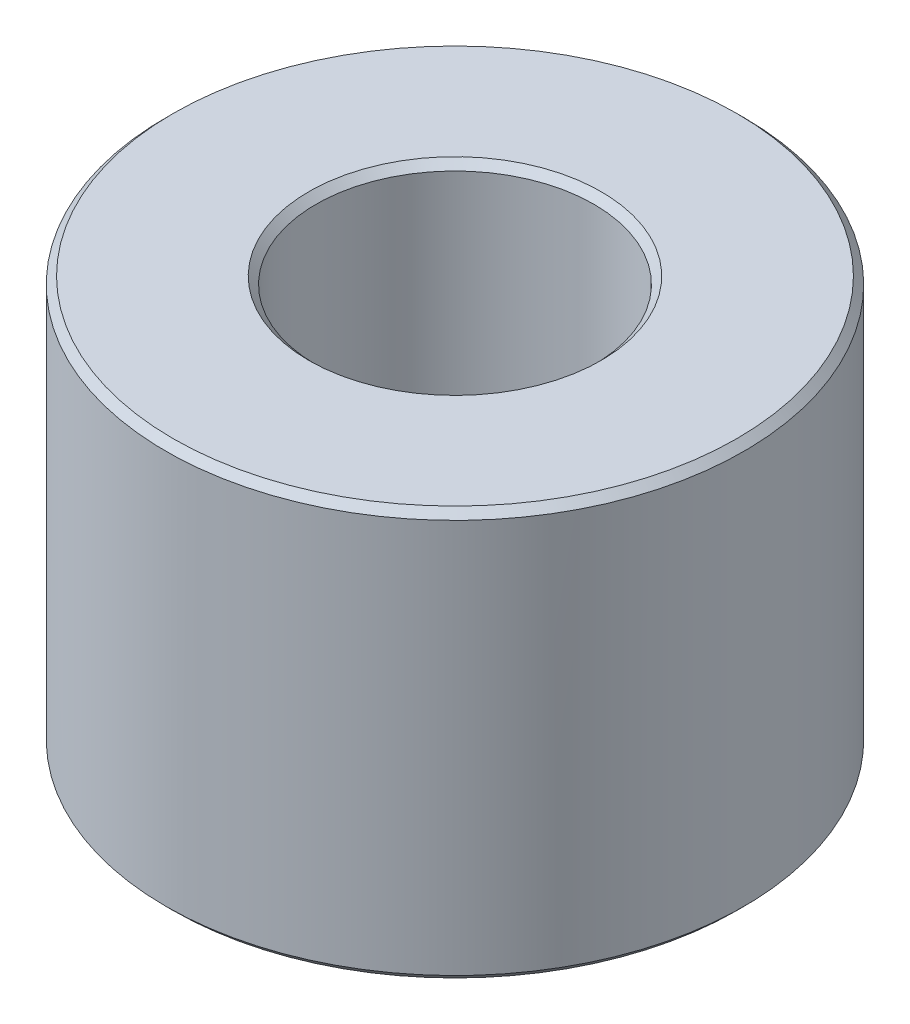
ISO-10303-21;
HEADER;
FILE_DESCRIPTION(('STEP AP214'),'2;1');
FILE_NAME('part.step','',(''),(''),'','','');
FILE_SCHEMA(('AUTOMOTIVE_DESIGN { 1 0 10303 214 1 1 1 1 }'));
ENDSEC;
DATA;
#1=APPLICATION_CONTEXT('core data for automotive mechanical design processes');
#2=APPLICATION_PROTOCOL_DEFINITION('international standard','automotive_design',2000,#1);
#3=PRODUCT_CONTEXT('',#1,'mechanical');
#4=PRODUCT('Part','Part','',(#3));
#5=PRODUCT_RELATED_PRODUCT_CATEGORY('part','',(#4));
#6=PRODUCT_DEFINITION_FORMATION('','',#4);
#7=PRODUCT_DEFINITION_CONTEXT('part definition',#1,'design');
#8=PRODUCT_DEFINITION('design','',#6,#7);
#9=PRODUCT_DEFINITION_SHAPE('','',#8);
#10=(LENGTH_UNIT() NAMED_UNIT(*) SI_UNIT(.MILLI.,.METRE.));
#11=(NAMED_UNIT(*) PLANE_ANGLE_UNIT() SI_UNIT($,.RADIAN.));
#12=(NAMED_UNIT(*) SI_UNIT($,.STERADIAN.) SOLID_ANGLE_UNIT());
#13=UNCERTAINTY_MEASURE_WITH_UNIT(LENGTH_MEASURE(1.E-05),#10,'distance_accuracy_value','');
#14=(GEOMETRIC_REPRESENTATION_CONTEXT(3) GLOBAL_UNCERTAINTY_ASSIGNED_CONTEXT((#13)) GLOBAL_UNIT_ASSIGNED_CONTEXT((#10,
#11,#12)) REPRESENTATION_CONTEXT('',''));
#15=CARTESIAN_POINT('',(0.,0.,0.));
#16=DIRECTION('',(0.,0.,1.));
#17=DIRECTION('',(1.,0.,0.));
#18=AXIS2_PLACEMENT_3D('',#15,#16,#17);
#19=CARTESIAN_POINT('',(0.,77.7720281529005,0.));
#20=DIRECTION('',(0.,-1.,0.));
#21=DIRECTION('',(0.,0.,-1.));
#22=AXIS2_PLACEMENT_3D('',#19,#20,#21);
#23=CYLINDRICAL_SURFACE('',#22,55.);
#24=CARTESIAN_POINT('',(0.,1.38214988164534,0.));
#25=DIRECTION('',(0.,1.,0.));
#26=DIRECTION('',(0.,0.,1.));
#27=AXIS2_PLACEMENT_3D('',#24,#25,#26);
#28=CIRCLE('',#27,55.);
#29=CARTESIAN_POINT('',(0.,1.38214988164534,-55.));
#30=VERTEX_POINT('',#29);
#31=EDGE_CURVE('E10',#30,#30,#28,.T.);
#32=CARTESIAN_POINT('',(0.,76.3898782712553,0.));
#33=DIRECTION('',(0.,1.,0.));
#34=DIRECTION('',(0.,0.,1.));
#35=AXIS2_PLACEMENT_3D('',#32,#33,#34);
#36=CIRCLE('',#35,55.);
#37=CARTESIAN_POINT('',(0.,76.3898782712553,-55.));
#38=VERTEX_POINT('',#37);
#39=EDGE_CURVE('E50',#38,#38,#36,.F.);
#40=CARTESIAN_POINT('',(0.,1.38214988164534,-55.));
#41=CARTESIAN_POINT('',(0.,2.16348038570377,-55.));
#42=CARTESIAN_POINT('',(0.,2.94481088976221,-55.));
#43=CARTESIAN_POINT('',(0.,4.50747189787909,-55.));
#44=CARTESIAN_POINT('',(0.,5.28880240193752,-55.));
#45=CARTESIAN_POINT('',(0.,6.8514634100544,-55.));
#46=CARTESIAN_POINT('',(0.,7.63279391411284,-55.));
#47=CARTESIAN_POINT('',(0.,9.19545492222971,-55.));
#48=CARTESIAN_POINT('',(0.,9.97678542628815,-55.));
#49=CARTESIAN_POINT('',(0.,11.539446434405,-55.));
#50=CARTESIAN_POINT('',(0.,12.3207769384635,-55.));
#51=CARTESIAN_POINT('',(0.,13.8834379465803,-55.));
#52=CARTESIAN_POINT('',(0.,14.6647684506388,-55.));
#53=CARTESIAN_POINT('',(0.,16.2274294587556,-55.));
#54=CARTESIAN_POINT('',(0.,17.0087599628141,-55.));
#55=CARTESIAN_POINT('',(0.,18.5714209709309,-55.));
#56=CARTESIAN_POINT('',(0.,19.3527514749894,-55.));
#57=CARTESIAN_POINT('',(0.,20.9154124831063,-55.));
#58=CARTESIAN_POINT('',(0.,21.6967429871647,-55.));
#59=CARTESIAN_POINT('',(0.,23.2594039952816,-55.));
#60=CARTESIAN_POINT('',(0.,24.04073449934,-55.));
#61=CARTESIAN_POINT('',(0.,25.6033955074569,-55.));
#62=CARTESIAN_POINT('',(0.,26.3847260115153,-55.));
#63=CARTESIAN_POINT('',(0.,27.9473870196322,-55.));
#64=CARTESIAN_POINT('',(0.,28.7287175236906,-55.));
#65=CARTESIAN_POINT('',(0.,30.2913785318075,-55.));
#66=CARTESIAN_POINT('',(0.,31.0727090358659,-55.));
#67=CARTESIAN_POINT('',(0.,32.6353700439828,-55.));
#68=CARTESIAN_POINT('',(0.,33.4167005480412,-55.));
#69=CARTESIAN_POINT('',(0.,34.9793615561581,-55.));
#70=CARTESIAN_POINT('',(0.,35.7606920602166,-55.));
#71=CARTESIAN_POINT('',(0.,37.3233530683334,-55.));
#72=CARTESIAN_POINT('',(0.,38.1046835723919,-55.));
#73=CARTESIAN_POINT('',(0.,39.6673445805087,-55.));
#74=CARTESIAN_POINT('',(0.,40.4486750845672,-55.));
#75=CARTESIAN_POINT('',(0.,42.0113360926841,-55.));
#76=CARTESIAN_POINT('',(0.,42.7926665967425,-55.));
#77=CARTESIAN_POINT('',(0.,44.3553276048594,-55.));
#78=CARTESIAN_POINT('',(0.,45.1366581089178,-55.));
#79=CARTESIAN_POINT('',(0.,46.6993191170347,-55.));
#80=CARTESIAN_POINT('',(0.,47.4806496210931,-55.));
#81=CARTESIAN_POINT('',(0.,49.04331062921,-55.));
#82=CARTESIAN_POINT('',(0.,49.8246411332684,-55.));
#83=CARTESIAN_POINT('',(0.,51.3873021413853,-55.));
#84=CARTESIAN_POINT('',(0.,52.1686326454437,-55.));
#85=CARTESIAN_POINT('',(0.,53.7312936535606,-55.));
#86=CARTESIAN_POINT('',(0.,54.512624157619,-55.));
#87=CARTESIAN_POINT('',(0.,56.0752851657359,-55.));
#88=CARTESIAN_POINT('',(0.,56.8566156697944,-55.));
#89=CARTESIAN_POINT('',(0.,58.4192766779112,-55.));
#90=CARTESIAN_POINT('',(0.,59.2006071819697,-55.));
#91=CARTESIAN_POINT('',(0.,60.7632681900865,-55.));
#92=CARTESIAN_POINT('',(0.,61.544598694145,-55.));
#93=CARTESIAN_POINT('',(0.,63.1072597022618,-55.));
#94=CARTESIAN_POINT('',(0.,63.8885902063203,-55.));
#95=CARTESIAN_POINT('',(0.,65.4512512144371,-55.));
#96=CARTESIAN_POINT('',(0.,66.2325817184956,-55.));
#97=CARTESIAN_POINT('',(0.,67.7952427266125,-55.));
#98=CARTESIAN_POINT('',(0.,68.5765732306709,-55.));
#99=CARTESIAN_POINT('',(0.,70.1392342387878,-55.));
#100=CARTESIAN_POINT('',(0.,70.9205647428462,-55.));
#101=CARTESIAN_POINT('',(0.,72.4832257509631,-55.));
#102=CARTESIAN_POINT('',(0.,73.2645562550215,-55.));
#103=CARTESIAN_POINT('',(0.,74.8272172631384,-55.));
#104=CARTESIAN_POINT('',(0.,75.6085477671968,-55.));
#105=CARTESIAN_POINT('',(0.,76.3898782712553,-55.));
#106=B_SPLINE_CURVE_WITH_KNOTS('',3,(#40,#41,#42,#43,#44,#45,#46,#47,#48,#49,#50,#51,#52,#53,
#54,#55,#56,#57,#58,#59,#60,#61,#62,#63,#64,#65,#66,#67,#68,#69,#70,#71,#72,#73,#74,#75,#76,#77,
#78,#79,#80,#81,#82,#83,#84,#85,#86,#87,#88,#89,#90,#91,#92,#93,#94,#95,#96,#97,#98,#99,#100,
#101,#102,#103,#104,#105),.UNSPECIFIED.,.F.,.F.,(4,2,2,2,2,2,2,2,2,2,2,2,2,2,2,2,2,2,2,2,2,2,2,
2,2,2,2,2,2,2,2,2,4),(0.,2.34399151217531,4.68798302435063,7.03197453652593,9.37596604870125,
11.7199575608766,14.0639490730519,16.4079405852272,18.7519320974025,21.0959236095778,
23.4399151217531,25.7839066339284,28.1278981461037,30.471889658279,32.8158811704543,
35.1598726826297,37.503864194805,39.8478557069803,42.1918472191556,44.5358387313309,
46.8798302435062,49.2238217556815,51.5678132678568,53.9118047800321,56.2557962922074,
58.5997878043828,60.9437793165581,63.2877708287334,65.6317623409087,67.975753853084,
70.3197453652593,72.6637368774346,75.0077283896099),.UNSPECIFIED.);
#107=EDGE_CURVE('BSEAM39',#30,#38,#106,.T.);
#108=ORIENTED_EDGE('',*,*,#31,.T.);
#109=ORIENTED_EDGE('',*,*,#39,.T.);
#110=ORIENTED_EDGE('',*,*,#107,.T.);
#111=ORIENTED_EDGE('',*,*,#107,.F.);
#112=EDGE_LOOP('',(#108,#110,#109,#111));
#113=FACE_BOUND('',#112,.T.);
#114=ADVANCED_FACE('F39',(#113),#23,.T.);
#115=CARTESIAN_POINT('',(0.,77.7720281529005,0.));
#116=DIRECTION('',(0.,1.,0.));
#117=DIRECTION('',(0.,0.,1.));
#118=AXIS2_PLACEMENT_3D('',#115,#116,#117);
#119=PLANE('',#118);
#120=CARTESIAN_POINT('',(0.,77.7720281529005,0.));
#121=DIRECTION('',(0.,1.,0.));
#122=DIRECTION('',(0.,0.,1.));
#123=AXIS2_PLACEMENT_3D('',#120,#121,#122);
#124=CIRCLE('',#123,27.8255249401882);
#125=CARTESIAN_POINT('',(0.,77.7720281529005,27.8255249401882));
#126=VERTEX_POINT('',#125);
#127=EDGE_CURVE('E58',#126,#126,#124,.F.);
#128=ORIENTED_EDGE('',*,*,#127,.T.);
#129=EDGE_LOOP('',(#128));
#130=FACE_BOUND('',#129,.T.);
#131=CARTESIAN_POINT('',(0.,77.7720281529005,0.));
#132=DIRECTION('',(0.,1.,0.));
#133=DIRECTION('',(0.,0.,1.));
#134=AXIS2_PLACEMENT_3D('',#131,#132,#133);
#135=CIRCLE('',#134,53.6178501183548);
#136=CARTESIAN_POINT('',(0.,77.7720281529005,53.6178501183548));
#137=VERTEX_POINT('',#136);
#138=EDGE_CURVE('E61',#137,#137,#135,.T.);
#139=ORIENTED_EDGE('',*,*,#138,.T.);
#140=EDGE_LOOP('',(#139));
#141=FACE_BOUND('',#140,.T.);
#142=ADVANCED_FACE('F88',(#130,#141),#119,.T.);
#143=CARTESIAN_POINT('',(0.,0.,0.));
#144=DIRECTION('',(0.,1.,0.));
#145=DIRECTION('',(0.,0.,1.));
#146=AXIS2_PLACEMENT_3D('',#143,#144,#145);
#147=PLANE('',#146);
#148=CARTESIAN_POINT('',(0.,0.,0.));
#149=DIRECTION('',(0.,1.,0.));
#150=DIRECTION('',(0.,0.,1.));
#151=AXIS2_PLACEMENT_3D('',#148,#149,#150);
#152=CIRCLE('',#151,27.8255249401881);
#153=CARTESIAN_POINT('',(0.,0.,27.8255249401881));
#154=VERTEX_POINT('',#153);
#155=EDGE_CURVE('E51',#154,#154,#152,.T.);
#156=ORIENTED_EDGE('',*,*,#155,.T.);
#157=EDGE_LOOP('',(#156));
#158=FACE_BOUND('',#157,.T.);
#159=CARTESIAN_POINT('',(0.,0.,0.));
#160=DIRECTION('',(0.,1.,0.));
#161=DIRECTION('',(0.,0.,1.));
#162=AXIS2_PLACEMENT_3D('',#159,#160,#161);
#163=CIRCLE('',#162,53.6178501183547);
#164=CARTESIAN_POINT('',(0.,0.,53.6178501183547));
#165=VERTEX_POINT('',#164);
#166=EDGE_CURVE('E54',#165,#165,#163,.F.);
#167=ORIENTED_EDGE('',*,*,#166,.T.);
#168=EDGE_LOOP('',(#167));
#169=FACE_BOUND('',#168,.T.);
#170=ADVANCED_FACE('F83',(#158,#169),#147,.F.);
#171=CARTESIAN_POINT('',(0.,77.7720281529005,0.));
#172=DIRECTION('',(0.,-1.,0.));
#173=DIRECTION('',(0.,0.,-1.));
#174=AXIS2_PLACEMENT_3D('',#171,#172,#173);
#175=CYLINDRICAL_SURFACE('',#174,26.4433750585428);
#176=CARTESIAN_POINT('',(0.,76.3898782712551,0.));
#177=DIRECTION('',(0.,1.,0.));
#178=DIRECTION('',(0.,0.,1.));
#179=AXIS2_PLACEMENT_3D('',#176,#177,#178);
#180=CIRCLE('',#179,26.4433750585428);
#181=CARTESIAN_POINT('',(0.,76.3898782712551,-26.4433750585428));
#182=VERTEX_POINT('',#181);
#183=EDGE_CURVE('E67',#182,#182,#180,.T.);
#184=CARTESIAN_POINT('',(0.,1.38214988164526,0.));
#185=DIRECTION('',(0.,1.,0.));
#186=DIRECTION('',(0.,0.,1.));
#187=AXIS2_PLACEMENT_3D('',#184,#185,#186);
#188=CIRCLE('',#187,26.4433750585428);
#189=CARTESIAN_POINT('',(0.,1.38214988164526,-26.4433750585428));
#190=VERTEX_POINT('',#189);
#191=EDGE_CURVE('E69',#190,#190,#188,.F.);
#192=CARTESIAN_POINT('',(0.,76.3898782712551,-26.4433750585428));
#193=CARTESIAN_POINT('',(0.,75.6085477671967,-26.4433750585428));
#194=CARTESIAN_POINT('',(0.,74.8272172631382,-26.4433750585428));
#195=CARTESIAN_POINT('',(0.,73.2645562550213,-26.4433750585428));
#196=CARTESIAN_POINT('',(0.,72.4832257509629,-26.4433750585428));
#197=CARTESIAN_POINT('',(0.,70.920564742846,-26.4433750585428));
#198=CARTESIAN_POINT('',(0.,70.1392342387876,-26.4433750585428));
#199=CARTESIAN_POINT('',(0.,68.5765732306707,-26.4433750585428));
#200=CARTESIAN_POINT('',(0.,67.7952427266123,-26.4433750585428));
#201=CARTESIAN_POINT('',(0.,66.2325817184954,-26.4433750585428));
#202=CARTESIAN_POINT('',(0.,65.451251214437,-26.4433750585428));
#203=CARTESIAN_POINT('',(0.,63.8885902063201,-26.4433750585428));
#204=CARTESIAN_POINT('',(0.,63.1072597022617,-26.4433750585428));
#205=CARTESIAN_POINT('',(0.,61.5445986941448,-26.4433750585428));
#206=CARTESIAN_POINT('',(0.,60.7632681900864,-26.4433750585428));
#207=CARTESIAN_POINT('',(0.,59.2006071819695,-26.4433750585428));
#208=CARTESIAN_POINT('',(0.,58.4192766779111,-26.4433750585428));
#209=CARTESIAN_POINT('',(0.,56.8566156697942,-26.4433750585428));
#210=CARTESIAN_POINT('',(0.,56.0752851657358,-26.4433750585428));
#211=CARTESIAN_POINT('',(0.,54.5126241576189,-26.4433750585428));
#212=CARTESIAN_POINT('',(0.,53.7312936535605,-26.4433750585428));
#213=CARTESIAN_POINT('',(0.,52.1686326454436,-26.4433750585428));
#214=CARTESIAN_POINT('',(0.,51.3873021413851,-26.4433750585428));
#215=CARTESIAN_POINT('',(0.,49.8246411332683,-26.4433750585428));
#216=CARTESIAN_POINT('',(0.,49.0433106292098,-26.4433750585428));
#217=CARTESIAN_POINT('',(0.,47.480649621093,-26.4433750585428));
#218=CARTESIAN_POINT('',(0.,46.6993191170345,-26.4433750585428));
#219=CARTESIAN_POINT('',(0.,45.1366581089177,-26.4433750585428));
#220=CARTESIAN_POINT('',(0.,44.3553276048592,-26.4433750585428));
#221=CARTESIAN_POINT('',(0.,42.7926665967424,-26.4433750585428));
#222=CARTESIAN_POINT('',(0.,42.0113360926839,-26.4433750585428));
#223=CARTESIAN_POINT('',(0.,40.448675084567,-26.4433750585428));
#224=CARTESIAN_POINT('',(0.,39.6673445805086,-26.4433750585428));
#225=CARTESIAN_POINT('',(0.,38.1046835723917,-26.4433750585428));
#226=CARTESIAN_POINT('',(0.,37.3233530683333,-26.4433750585428));
#227=CARTESIAN_POINT('',(0.,35.7606920602164,-26.4433750585428));
#228=CARTESIAN_POINT('',(0.,34.979361556158,-26.4433750585428));
#229=CARTESIAN_POINT('',(0.,33.4167005480411,-26.4433750585428));
#230=CARTESIAN_POINT('',(0.,32.6353700439827,-26.4433750585428));
#231=CARTESIAN_POINT('',(0.,31.0727090358658,-26.4433750585428));
#232=CARTESIAN_POINT('',(0.,30.2913785318074,-26.4433750585428));
#233=CARTESIAN_POINT('',(0.,28.7287175236905,-26.4433750585428));
#234=CARTESIAN_POINT('',(0.,27.9473870196321,-26.4433750585428));
#235=CARTESIAN_POINT('',(0.,26.3847260115152,-26.4433750585428));
#236=CARTESIAN_POINT('',(0.,25.6033955074568,-26.4433750585428));
#237=CARTESIAN_POINT('',(0.,24.0407344993399,-26.4433750585428));
#238=CARTESIAN_POINT('',(0.,23.2594039952815,-26.4433750585428));
#239=CARTESIAN_POINT('',(0.,21.6967429871646,-26.4433750585428));
#240=CARTESIAN_POINT('',(0.,20.9154124831061,-26.4433750585428));
#241=CARTESIAN_POINT('',(0.,19.3527514749893,-26.4433750585428));
#242=CARTESIAN_POINT('',(0.,18.5714209709308,-26.4433750585428));
#243=CARTESIAN_POINT('',(0.,17.008759962814,-26.4433750585428));
#244=CARTESIAN_POINT('',(0.,16.2274294587555,-26.4433750585428));
#245=CARTESIAN_POINT('',(0.,14.6647684506387,-26.4433750585428));
#246=CARTESIAN_POINT('',(0.,13.8834379465802,-26.4433750585428));
#247=CARTESIAN_POINT('',(0.,12.3207769384634,-26.4433750585428));
#248=CARTESIAN_POINT('',(0.,11.5394464344049,-26.4433750585428));
#249=CARTESIAN_POINT('',(0.,9.97678542628804,-26.4433750585428));
#250=CARTESIAN_POINT('',(0.,9.19545492222961,-26.4433750585428));
#251=CARTESIAN_POINT('',(0.,7.63279391411274,-26.4433750585428));
#252=CARTESIAN_POINT('',(0.,6.8514634100543,-26.4433750585428));
#253=CARTESIAN_POINT('',(0.,5.28880240193743,-26.4433750585428));
#254=CARTESIAN_POINT('',(0.,4.507471897879,-26.4433750585428));
#255=CARTESIAN_POINT('',(0.,2.94481088976213,-26.4433750585428));
#256=CARTESIAN_POINT('',(0.,2.16348038570369,-26.4433750585428));
#257=CARTESIAN_POINT('',(0.,1.38214988164526,-26.4433750585428));
#258=B_SPLINE_CURVE_WITH_KNOTS('',3,(#192,#193,#194,#195,#196,#197,#198,#199,#200,#201,#202,
#203,#204,#205,#206,#207,#208,#209,#210,#211,#212,#213,#214,#215,#216,#217,#218,#219,#220,#221,
#222,#223,#224,#225,#226,#227,#228,#229,#230,#231,#232,#233,#234,#235,#236,#237,#238,#239,#240,
#241,#242,#243,#244,#245,#246,#247,#248,#249,#250,#251,#252,#253,#254,#255,#256,#257),
.UNSPECIFIED.,.F.,.F.,(4,2,2,2,2,2,2,2,2,2,2,2,2,2,2,2,2,2,2,2,2,2,2,2,2,2,2,2,2,2,2,2,4),(0.,
2.34399151217531,4.68798302435061,7.03197453652592,9.37596604870122,11.7199575608765,
14.0639490730518,16.4079405852271,18.7519320974024,21.0959236095778,23.4399151217531,
25.7839066339284,28.1278981461037,30.471889658279,32.8158811704543,35.1598726826296,
37.5038641948049,39.8478557069802,42.1918472191555,44.5358387313308,46.8798302435061,
49.2238217556814,51.5678132678568,53.9118047800321,56.2557962922074,58.5997878043827,
60.943779316558,63.2877708287333,65.6317623409086,67.9757538530839,70.3197453652592,
72.6637368774345,75.0077283896098),.UNSPECIFIED.);
#259=EDGE_CURVE('BSEAM71',#182,#190,#258,.T.);
#260=ORIENTED_EDGE('',*,*,#183,.T.);
#261=ORIENTED_EDGE('',*,*,#191,.T.);
#262=ORIENTED_EDGE('',*,*,#259,.T.);
#263=ORIENTED_EDGE('',*,*,#259,.F.);
#264=EDGE_LOOP('',(#260,#262,#261,#263));
#265=FACE_BOUND('',#264,.T.);
#266=ADVANCED_FACE('F71',(#265),#175,.F.);
#267=CARTESIAN_POINT('',(0.,76.3898782712551,0.));
#268=DIRECTION('',(0.,1.,0.));
#269=DIRECTION('',(0.,0.,1.));
#270=AXIS2_PLACEMENT_3D('',#267,#268,#269);
#271=CONICAL_SURFACE('',#270,26.4433750585428,0.785398163397448);
#272=ORIENTED_EDGE('',*,*,#127,.F.);
#273=EDGE_LOOP('',(#272));
#274=FACE_BOUND('',#273,.T.);
#275=ORIENTED_EDGE('',*,*,#183,.F.);
#276=EDGE_LOOP('',(#275));
#277=FACE_BOUND('',#276,.T.);
#278=ADVANCED_FACE('F77',(#274,#277),#271,.F.);
#279=CARTESIAN_POINT('',(0.,0.,0.));
#280=DIRECTION('',(0.,-1.,0.));
#281=DIRECTION('',(0.,0.,-1.));
#282=AXIS2_PLACEMENT_3D('',#279,#280,#281);
#283=CONICAL_SURFACE('',#282,27.8255249401881,0.785398163397438);
#284=ORIENTED_EDGE('',*,*,#191,.F.);
#285=EDGE_LOOP('',(#284));
#286=FACE_BOUND('',#285,.T.);
#287=ORIENTED_EDGE('',*,*,#155,.F.);
#288=EDGE_LOOP('',(#287));
#289=FACE_BOUND('',#288,.T.);
#290=ADVANCED_FACE('F73',(#286,#289),#283,.F.);
#291=CARTESIAN_POINT('',(0.,1.38214988164533,0.));
#292=DIRECTION('',(0.,1.,0.));
#293=DIRECTION('',(0.,0.,1.));
#294=AXIS2_PLACEMENT_3D('',#291,#292,#293);
#295=CONICAL_SURFACE('',#294,55.,0.785398163397453);
#296=ORIENTED_EDGE('',*,*,#166,.F.);
#297=EDGE_LOOP('',(#296));
#298=FACE_BOUND('',#297,.T.);
#299=ORIENTED_EDGE('',*,*,#31,.F.);
#300=EDGE_LOOP('',(#299));
#301=FACE_BOUND('',#300,.T.);
#302=ADVANCED_FACE('F76',(#298,#301),#295,.T.);
#303=CARTESIAN_POINT('',(0.,77.7720281529005,0.));
#304=DIRECTION('',(0.,-1.,0.));
#305=DIRECTION('',(0.,0.,-1.));
#306=AXIS2_PLACEMENT_3D('',#303,#304,#305);
#307=CONICAL_SURFACE('',#306,53.6178501183548,0.785398163397431);
#308=ORIENTED_EDGE('',*,*,#39,.F.);
#309=EDGE_LOOP('',(#308));
#310=FACE_BOUND('',#309,.T.);
#311=ORIENTED_EDGE('',*,*,#138,.F.);
#312=EDGE_LOOP('',(#311));
#313=FACE_BOUND('',#312,.T.);
#314=ADVANCED_FACE('F45',(#310,#313),#307,.T.);
#315=CLOSED_SHELL('',(#114,#142,#170,#266,#278,#290,#302,#314));
#316=MANIFOLD_SOLID_BREP('B2',#315);
#317=ADVANCED_BREP_SHAPE_REPRESENTATION('',(#18,#316),#14);
#318=SHAPE_DEFINITION_REPRESENTATION(#9,#317);
ENDSEC;
END-ISO-10303-21;
